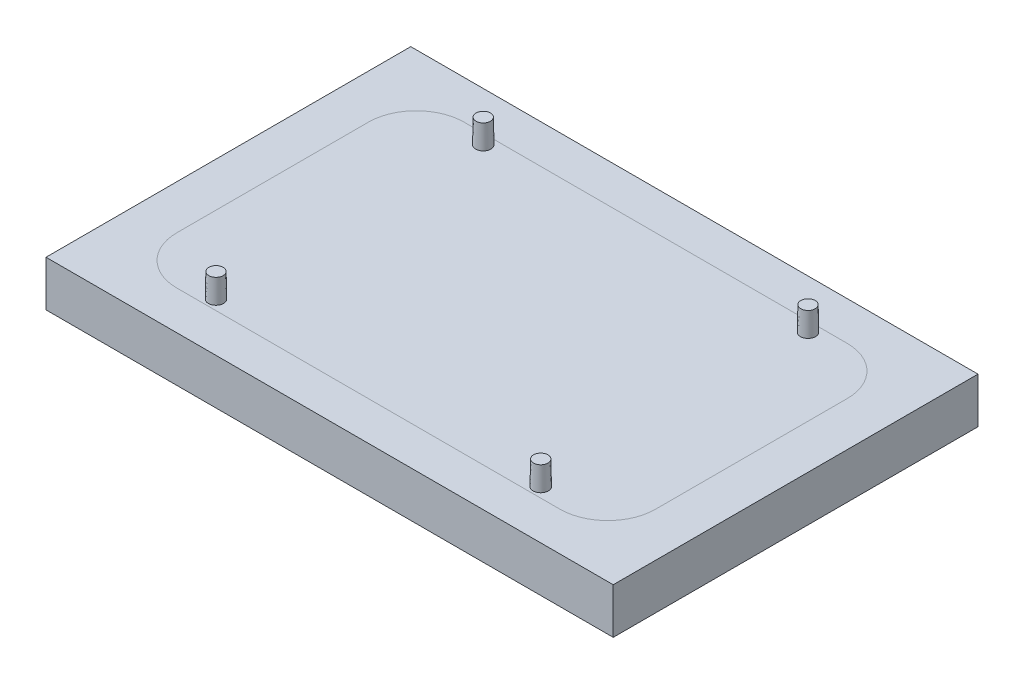
ISO-10303-21;
HEADER;
FILE_DESCRIPTION(('STEP AP214'),'2;1');
FILE_NAME('part.step','',(''),(''),'','','');
FILE_SCHEMA(('AUTOMOTIVE_DESIGN { 1 0 10303 214 1 1 1 1 }'));
ENDSEC;
DATA;
#1=APPLICATION_CONTEXT('core data for automotive mechanical design processes');
#2=APPLICATION_PROTOCOL_DEFINITION('international standard','automotive_design',2000,#1);
#3=PRODUCT_CONTEXT('',#1,'mechanical');
#4=PRODUCT('Part','Part','',(#3));
#5=PRODUCT_RELATED_PRODUCT_CATEGORY('part','',(#4));
#6=PRODUCT_DEFINITION_FORMATION('','',#4);
#7=PRODUCT_DEFINITION_CONTEXT('part definition',#1,'design');
#8=PRODUCT_DEFINITION('design','',#6,#7);
#9=PRODUCT_DEFINITION_SHAPE('','',#8);
#10=(LENGTH_UNIT() NAMED_UNIT(*) SI_UNIT(.MILLI.,.METRE.));
#11=(NAMED_UNIT(*) PLANE_ANGLE_UNIT() SI_UNIT($,.RADIAN.));
#12=(NAMED_UNIT(*) SI_UNIT($,.STERADIAN.) SOLID_ANGLE_UNIT());
#13=UNCERTAINTY_MEASURE_WITH_UNIT(LENGTH_MEASURE(1.E-05),#10,'distance_accuracy_value','');
#14=(GEOMETRIC_REPRESENTATION_CONTEXT(3) GLOBAL_UNCERTAINTY_ASSIGNED_CONTEXT((#13)) GLOBAL_UNIT_ASSIGNED_CONTEXT((#10,
#11,#12)) REPRESENTATION_CONTEXT('',''));
#15=CARTESIAN_POINT('',(0.,0.,0.));
#16=DIRECTION('',(0.,0.,1.));
#17=DIRECTION('',(1.,0.,0.));
#18=AXIS2_PLACEMENT_3D('',#15,#16,#17);
#19=CARTESIAN_POINT('',(0.,-94.8749129032242,0.));
#20=DIRECTION('',(0.,1.,0.));
#21=DIRECTION('',(0.,0.,1.));
#22=AXIS2_PLACEMENT_3D('',#19,#20,#21);
#23=PLANE('',#22);
#24=CARTESIAN_POINT('',(35.6083609091269,-94.8749129032242,29.3083609091269));
#25=DIRECTION('',(0.,1.,0.));
#26=DIRECTION('',(0.,0.,1.));
#27=AXIS2_PLACEMENT_3D('',#24,#25,#26);
#28=CIRCLE('',#27,1.575);
#29=CARTESIAN_POINT('',(35.6083609091269,-94.8749129032242,30.8833609091269));
#30=VERTEX_POINT('',#29);
#31=EDGE_CURVE('E157',#30,#30,#28,.T.);
#32=ORIENTED_EDGE('',*,*,#31,.T.);
#33=EDGE_LOOP('',(#32));
#34=FACE_BOUND('',#33,.T.);
#35=ADVANCED_FACE('F40',(#34),#23,.T.);
#36=CARTESIAN_POINT('',(35.6083609091269,-94.8749129032242,29.3083609091269));
#37=DIRECTION('',(0.,-1.,0.));
#38=DIRECTION('',(0.,0.,1.));
#39=AXIS2_PLACEMENT_3D('',#36,#37,#38);
#40=CONICAL_SURFACE('',#39,1.575,0.0174532925199433);
#41=CARTESIAN_POINT('',(35.6083609091269,-100.124912903224,29.3083609091269));
#42=DIRECTION('',(0.,1.,0.));
#43=DIRECTION('',(0.,0.,1.));
#44=AXIS2_PLACEMENT_3D('',#41,#42,#43);
#45=CIRCLE('',#44,1.66663909087315);
#46=CARTESIAN_POINT('',(35.6083609091269,-100.124912903224,30.975));
#47=VERTEX_POINT('',#46);
#48=EDGE_CURVE('E152',#47,#47,#45,.T.);
#49=ORIENTED_EDGE('',*,*,#48,.T.);
#50=EDGE_LOOP('',(#49));
#51=FACE_BOUND('',#50,.T.);
#52=ORIENTED_EDGE('',*,*,#31,.F.);
#53=EDGE_LOOP('',(#52));
#54=FACE_BOUND('',#53,.T.);
#55=ADVANCED_FACE('F285',(#51,#54),#40,.T.);
#56=CARTESIAN_POINT('',(35.6083609091269,-94.8749129032242,-29.3083609091269));
#57=DIRECTION('',(0.,-1.,0.));
#58=DIRECTION('',(0.,0.,-1.));
#59=AXIS2_PLACEMENT_3D('',#56,#57,#58);
#60=CONICAL_SURFACE('',#59,1.575,0.0174532925199433);
#61=CARTESIAN_POINT('',(35.6083609091269,-100.124912903224,-29.3083609091269));
#62=DIRECTION('',(0.,1.,0.));
#63=DIRECTION('',(0.,0.,1.));
#64=AXIS2_PLACEMENT_3D('',#61,#62,#63);
#65=CIRCLE('',#64,1.66663909087315);
#66=CARTESIAN_POINT('',(35.6083609091269,-100.124912903224,-27.6417218182537));
#67=VERTEX_POINT('',#66);
#68=EDGE_CURVE('E133',#67,#67,#65,.F.);
#69=ORIENTED_EDGE('',*,*,#68,.F.);
#70=EDGE_LOOP('',(#69));
#71=FACE_BOUND('',#70,.T.);
#72=CARTESIAN_POINT('',(35.6083609091269,-94.8749129032242,-29.3083609091269));
#73=DIRECTION('',(0.,-1.,0.));
#74=DIRECTION('',(0.,0.,-1.));
#75=AXIS2_PLACEMENT_3D('',#72,#73,#74);
#76=CIRCLE('',#75,1.575);
#77=CARTESIAN_POINT('',(35.6083609091269,-94.8749129032242,-30.8833609091269));
#78=VERTEX_POINT('',#77);
#79=EDGE_CURVE('E148',#78,#78,#76,.T.);
#80=ORIENTED_EDGE('',*,*,#79,.T.);
#81=EDGE_LOOP('',(#80));
#82=FACE_BOUND('',#81,.T.);
#83=ADVANCED_FACE('F297',(#71,#82),#60,.T.);
#84=CARTESIAN_POINT('',(-35.6083609091269,-94.8749129032242,-29.3083609091269));
#85=DIRECTION('',(0.,-1.,0.));
#86=DIRECTION('',(0.,0.,-1.));
#87=AXIS2_PLACEMENT_3D('',#84,#85,#86);
#88=CONICAL_SURFACE('',#87,1.575,0.0174532925199433);
#89=CARTESIAN_POINT('',(-35.6083609091269,-100.124912903224,-29.3083609091269));
#90=DIRECTION('',(0.,1.,0.));
#91=DIRECTION('',(0.,0.,1.));
#92=AXIS2_PLACEMENT_3D('',#89,#90,#91);
#93=CIRCLE('',#92,1.66663909087315);
#94=CARTESIAN_POINT('',(-35.6083609091269,-100.124912903224,-27.6417218182537));
#95=VERTEX_POINT('',#94);
#96=EDGE_CURVE('E139',#95,#95,#93,.T.);
#97=ORIENTED_EDGE('',*,*,#96,.T.);
#98=EDGE_LOOP('',(#97));
#99=FACE_BOUND('',#98,.T.);
#100=CARTESIAN_POINT('',(-35.6083609091269,-94.8749129032242,-29.3083609091269));
#101=DIRECTION('',(0.,1.,0.));
#102=DIRECTION('',(0.,0.,-1.));
#103=AXIS2_PLACEMENT_3D('',#100,#101,#102);
#104=CIRCLE('',#103,1.575);
#105=CARTESIAN_POINT('',(-35.6083609091269,-94.8749129032242,-30.8833609091269));
#106=VERTEX_POINT('',#105);
#107=EDGE_CURVE('E122',#106,#106,#104,.T.);
#108=ORIENTED_EDGE('',*,*,#107,.F.);
#109=EDGE_LOOP('',(#108));
#110=FACE_BOUND('',#109,.T.);
#111=ADVANCED_FACE('F308',(#99,#110),#88,.T.);
#112=CARTESIAN_POINT('',(-35.6083609091269,-94.8749129032242,29.3083609091269));
#113=DIRECTION('',(0.,-1.,0.));
#114=DIRECTION('',(0.,0.,1.));
#115=AXIS2_PLACEMENT_3D('',#112,#113,#114);
#116=CONICAL_SURFACE('',#115,1.575,0.0174532925199433);
#117=CARTESIAN_POINT('',(-35.6083609091269,-100.124912903224,29.3083609091269));
#118=DIRECTION('',(0.,1.,0.));
#119=DIRECTION('',(0.,0.,1.));
#120=AXIS2_PLACEMENT_3D('',#117,#118,#119);
#121=CIRCLE('',#120,1.66663909087315);
#122=CARTESIAN_POINT('',(-35.6083609091269,-100.124912903224,30.975));
#123=VERTEX_POINT('',#122);
#124=EDGE_CURVE('E138',#123,#123,#121,.F.);
#125=ORIENTED_EDGE('',*,*,#124,.F.);
#126=EDGE_LOOP('',(#125));
#127=FACE_BOUND('',#126,.T.);
#128=CARTESIAN_POINT('',(-35.6083609091269,-94.8749129032242,29.3083609091269));
#129=DIRECTION('',(0.,-1.,0.));
#130=DIRECTION('',(0.,0.,1.));
#131=AXIS2_PLACEMENT_3D('',#128,#129,#130);
#132=CIRCLE('',#131,1.575);
#133=CARTESIAN_POINT('',(-35.6083609091269,-94.8749129032242,30.8833609091269));
#134=VERTEX_POINT('',#133);
#135=EDGE_CURVE('E134',#134,#134,#132,.T.);
#136=ORIENTED_EDGE('',*,*,#135,.T.);
#137=EDGE_LOOP('',(#136));
#138=FACE_BOUND('',#137,.T.);
#139=ADVANCED_FACE('F319',(#127,#138),#116,.T.);
#140=CARTESIAN_POINT('',(0.,-100.124912903224,0.));
#141=DIRECTION('',(0.,1.,0.));
#142=DIRECTION('',(0.,0.,1.));
#143=AXIS2_PLACEMENT_3D('',#140,#141,#142);
#144=PLANE('',#143);
#145=ORIENTED_EDGE('',*,*,#124,.T.);
#146=EDGE_LOOP('',(#145));
#147=FACE_BOUND('',#146,.T.);
#148=ORIENTED_EDGE('',*,*,#96,.F.);
#149=EDGE_LOOP('',(#148));
#150=FACE_BOUND('',#149,.T.);
#151=ORIENTED_EDGE('',*,*,#68,.T.);
#152=EDGE_LOOP('',(#151));
#153=FACE_BOUND('',#152,.T.);
#154=ORIENTED_EDGE('',*,*,#48,.F.);
#155=EDGE_LOOP('',(#154));
#156=FACE_BOUND('',#155,.T.);
#157=DIRECTION('',(0.,0.,-1.));
#158=VECTOR('',#157,1.);
#159=CARTESIAN_POINT('',(52.5,-100.124912903224,-31.5));
#160=LINE('',#159,#158);
#161=CARTESIAN_POINT('',(52.5,-100.124912903224,21.0015992008579));
#162=VERTEX_POINT('',#161);
#163=CARTESIAN_POINT('',(52.5,-100.124912903224,-21.0015992008579));
#164=VERTEX_POINT('',#163);
#165=EDGE_CURVE('E107',#162,#164,#160,.T.);
#166=ORIENTED_EDGE('',*,*,#165,.T.);
#167=CARTESIAN_POINT('',(42.0015992008579,-100.124912903224,-31.5));
#168=CARTESIAN_POINT('',(43.035443156018,-100.124912903224,-31.5));
#169=CARTESIAN_POINT('',(44.0499059363075,-100.124912903224,-31.2982927069863));
#170=CARTESIAN_POINT('',(45.0635805260425,-100.124912903224,-31.096742131189));
#171=CARTESIAN_POINT('',(46.0194049436303,-100.124912903224,-30.700919329927));
#172=CARTESIAN_POINT('',(46.9742363236567,-100.124912903224,-30.3055077620486));
#173=CARTESIAN_POINT('',(47.8344387355147,-100.124912903224,-29.7308277192793));
#174=CARTESIAN_POINT('',(48.6937474546659,-100.124912903224,-29.1567447305938));
#175=CARTESIAN_POINT('',(49.4252835418195,-100.124912903224,-28.4252835418196));
#176=CARTESIAN_POINT('',(50.1560596120772,-100.124912903224,-27.694582292127));
#177=CARTESIAN_POINT('',(50.7308277192793,-100.124912903224,-26.8344387355147));
#178=CARTESIAN_POINT('',(51.3049986809784,-100.124912903224,-25.9751888103518));
#179=CARTESIAN_POINT('',(51.700919329927,-100.124912903224,-25.0194049436303));
#180=CARTESIAN_POINT('',(52.09642864384,-100.124912903224,-24.0646140723282));
#181=CARTESIAN_POINT('',(52.2982927069862,-100.124912903224,-23.0499059363075));
#182=CARTESIAN_POINT('',(52.5,-100.124912903224,-22.0359858351972));
#183=CARTESIAN_POINT('',(52.5,-100.124912903224,-21.0015992008579));
#184=B_SPLINE_CURVE_WITH_KNOTS('',2,(#167,#168,#169,#170,#171,#172,#173,#174,#175,#176,#177,
#178,#179,#180,#181,#182,#183),.UNSPECIFIED.,.F.,.F.,(3,2,2,2,2,2,2,2,3),(0.,0.125,0.25,0.375,
0.5,0.625,0.75,0.875,1.),.UNSPECIFIED.);
#185=CARTESIAN_POINT('',(42.0015992008579,-100.124912903224,-31.5));
#186=VERTEX_POINT('',#185);
#187=EDGE_CURVE('E98',#186,#164,#184,.T.);
#188=ORIENTED_EDGE('',*,*,#187,.F.);
#189=DIRECTION('',(-1.,0.,0.));
#190=VECTOR('',#189,1.);
#191=CARTESIAN_POINT('',(-52.5,-100.124912903224,-31.5));
#192=LINE('',#191,#190);
#193=CARTESIAN_POINT('',(-42.0015992008579,-100.124912903224,-31.5));
#194=VERTEX_POINT('',#193);
#195=EDGE_CURVE('E101',#186,#194,#192,.T.);
#196=ORIENTED_EDGE('',*,*,#195,.T.);
#197=CARTESIAN_POINT('',(-52.5,-100.124912903224,-21.0015992008579));
#198=CARTESIAN_POINT('',(-52.5,-100.124912903224,-22.0354431560098));
#199=CARTESIAN_POINT('',(-52.2982927069863,-100.124912903224,-23.0499059363075));
#200=CARTESIAN_POINT('',(-52.0967421311872,-100.124912903224,-24.0635805260594));
#201=CARTESIAN_POINT('',(-51.700919329927,-100.124912903224,-25.0194049436303));
#202=CARTESIAN_POINT('',(-51.30550776199,-100.124912903224,-25.9742363237855));
#203=CARTESIAN_POINT('',(-50.7308277192793,-100.124912903224,-26.8344387355147));
#204=CARTESIAN_POINT('',(-50.1567447305454,-100.124912903224,-27.6937474546972));
#205=CARTESIAN_POINT('',(-49.4252835418196,-100.124912903224,-28.4252835418196));
#206=CARTESIAN_POINT('',(-48.6945822921659,-100.124912903224,-29.1560596120554));
#207=CARTESIAN_POINT('',(-47.8344387355147,-100.124912903224,-29.7308277192793));
#208=CARTESIAN_POINT('',(-46.9751888102959,-100.124912903224,-30.3049986810116));
#209=CARTESIAN_POINT('',(-46.0194049436303,-100.124912903224,-30.700919329927));
#210=CARTESIAN_POINT('',(-45.0646140722493,-100.124912903224,-31.0964286438627));
#211=CARTESIAN_POINT('',(-44.0499059363075,-100.124912903224,-31.2982927069862));
#212=CARTESIAN_POINT('',(-43.0359858351619,-100.124912903224,-31.5));
#213=CARTESIAN_POINT('',(-42.0015992008579,-100.124912903224,-31.5));
#214=B_SPLINE_CURVE_WITH_KNOTS('',2,(#197,#198,#199,#200,#201,#202,#203,#204,#205,#206,#207,
#208,#209,#210,#211,#212,#213),.UNSPECIFIED.,.F.,.F.,(3,2,2,2,2,2,2,2,3),(0.,0.125,0.25,0.375,
0.5,0.625,0.75,0.875,1.),.UNSPECIFIED.);
#215=CARTESIAN_POINT('',(-52.5,-100.124912903224,-21.0015992008579));
#216=VERTEX_POINT('',#215);
#217=EDGE_CURVE('E103',#216,#194,#214,.T.);
#218=ORIENTED_EDGE('',*,*,#217,.F.);
#219=DIRECTION('',(0.,0.,1.));
#220=VECTOR('',#219,1.);
#221=CARTESIAN_POINT('',(-52.5,-100.124912903224,-31.5));
#222=LINE('',#221,#220);
#223=CARTESIAN_POINT('',(-52.5,-100.124912903224,21.0015992008579));
#224=VERTEX_POINT('',#223);
#225=EDGE_CURVE('E106',#216,#224,#222,.T.);
#226=ORIENTED_EDGE('',*,*,#225,.T.);
#227=CARTESIAN_POINT('',(-42.0015992008579,-100.124912903224,31.5));
#228=CARTESIAN_POINT('',(-43.0354431560279,-100.124912903224,31.5));
#229=CARTESIAN_POINT('',(-44.0499059363075,-100.124912903224,31.2982927069862));
#230=CARTESIAN_POINT('',(-45.0635805260743,-100.124912903224,31.0967421311807));
#231=CARTESIAN_POINT('',(-46.0194049436303,-100.124912903224,30.700919329927));
#232=CARTESIAN_POINT('',(-46.9742363237623,-100.124912903224,30.305507762));
#233=CARTESIAN_POINT('',(-47.8344387355147,-100.124912903224,29.7308277192793));
#234=CARTESIAN_POINT('',(-48.6937474547037,-100.124912903224,29.1567447305465));
#235=CARTESIAN_POINT('',(-49.4252835418196,-100.124912903224,28.4252835418195));
#236=CARTESIAN_POINT('',(-50.1560596120963,-100.124912903224,27.6945822921173));
#237=CARTESIAN_POINT('',(-50.7308277192793,-100.124912903224,26.8344387355146));
#238=CARTESIAN_POINT('',(-51.3049986810359,-100.124912903224,25.9751888102467));
#239=CARTESIAN_POINT('',(-51.700919329927,-100.124912903224,25.0194049436303));
#240=CARTESIAN_POINT('',(-52.0964286438583,-100.124912903224,24.0646140722504));
#241=CARTESIAN_POINT('',(-52.2982927069862,-100.124912903224,23.0499059363075));
#242=CARTESIAN_POINT('',(-52.5,-100.124912903224,22.0359858351833));
#243=CARTESIAN_POINT('',(-52.5,-100.124912903224,21.0015992008579));
#244=B_SPLINE_CURVE_WITH_KNOTS('',2,(#227,#228,#229,#230,#231,#232,#233,#234,#235,#236,#237,
#238,#239,#240,#241,#242,#243),.UNSPECIFIED.,.F.,.F.,(3,2,2,2,2,2,2,2,3),(0.,0.125,0.25,0.375,
0.5,0.625,0.75,0.875,1.),.UNSPECIFIED.);
#245=CARTESIAN_POINT('',(-42.0015992008579,-100.124912903224,31.5));
#246=VERTEX_POINT('',#245);
#247=EDGE_CURVE('E119',#246,#224,#244,.T.);
#248=ORIENTED_EDGE('',*,*,#247,.F.);
#249=DIRECTION('',(1.,0.,0.));
#250=VECTOR('',#249,1.);
#251=CARTESIAN_POINT('',(-52.5,-100.124912903224,31.5));
#252=LINE('',#251,#250);
#253=CARTESIAN_POINT('',(42.0015992008579,-100.124912903224,31.5));
#254=VERTEX_POINT('',#253);
#255=EDGE_CURVE('E145',#246,#254,#252,.T.);
#256=ORIENTED_EDGE('',*,*,#255,.T.);
#257=CARTESIAN_POINT('',(52.5,-100.124912903224,21.0015992008579));
#258=CARTESIAN_POINT('',(52.5,-100.124912903224,22.0354431560371));
#259=CARTESIAN_POINT('',(52.2982927069862,-100.124912903224,23.0499059363075));
#260=CARTESIAN_POINT('',(52.0967421311642,-100.124912903224,24.0635805261478));
#261=CARTESIAN_POINT('',(51.700919329927,-100.124912903224,25.0194049436303));
#262=CARTESIAN_POINT('',(51.3055077619451,-100.124912903224,25.9742363238612));
#263=CARTESIAN_POINT('',(50.7308277192793,-100.124912903224,26.8344387355147));
#264=CARTESIAN_POINT('',(50.1567447306082,-100.124912903224,27.6937474545948));
#265=CARTESIAN_POINT('',(49.4252835418196,-100.124912903224,28.4252835418196));
#266=CARTESIAN_POINT('',(48.6945822922835,-100.124912903224,29.1560596119773));
#267=CARTESIAN_POINT('',(47.8344387355147,-100.124912903224,29.7308277192793));
#268=CARTESIAN_POINT('',(46.9751888103641,-100.124912903224,30.3049986809655));
#269=CARTESIAN_POINT('',(46.0194049436303,-100.124912903224,30.700919329927));
#270=CARTESIAN_POINT('',(45.0646140723647,-100.124912903224,31.0964286438328));
#271=CARTESIAN_POINT('',(44.0499059363075,-100.124912903224,31.2982927069862));
#272=CARTESIAN_POINT('',(43.0359858351971,-100.124912903224,31.5));
#273=CARTESIAN_POINT('',(42.0015992008579,-100.124912903224,31.5));
#274=B_SPLINE_CURVE_WITH_KNOTS('',2,(#257,#258,#259,#260,#261,#262,#263,#264,#265,#266,#267,
#268,#269,#270,#271,#272,#273),.UNSPECIFIED.,.F.,.F.,(3,2,2,2,2,2,2,2,3),(0.,0.125,0.25,0.375,
0.5,0.625,0.75,0.875,1.),.UNSPECIFIED.);
#275=EDGE_CURVE('E112',#162,#254,#274,.T.);
#276=ORIENTED_EDGE('',*,*,#275,.F.);
#277=EDGE_LOOP('',(#166,#188,#196,#218,#226,#248,#256,#276));
#278=FACE_BOUND('',#277,.T.);
#279=ADVANCED_FACE('F109',(#147,#150,#153,#156,#278),#144,.T.);
#280=CARTESIAN_POINT('',(0.,-94.8749129032242,0.));
#281=DIRECTION('',(0.,1.,0.));
#282=DIRECTION('',(0.,0.,1.));
#283=AXIS2_PLACEMENT_3D('',#280,#281,#282);
#284=PLANE('',#283);
#285=ORIENTED_EDGE('',*,*,#79,.F.);
#286=EDGE_LOOP('',(#285));
#287=FACE_BOUND('',#286,.T.);
#288=ADVANCED_FACE('F340',(#287),#284,.T.);
#289=CARTESIAN_POINT('',(0.,-94.8749129032242,0.));
#290=DIRECTION('',(0.,1.,0.));
#291=DIRECTION('',(0.,0.,1.));
#292=AXIS2_PLACEMENT_3D('',#289,#290,#291);
#293=PLANE('',#292);
#294=ORIENTED_EDGE('',*,*,#107,.T.);
#295=EDGE_LOOP('',(#294));
#296=FACE_BOUND('',#295,.T.);
#297=ADVANCED_FACE('F351',(#296),#293,.T.);
#298=CARTESIAN_POINT('',(0.,-94.8749129032242,0.));
#299=DIRECTION('',(0.,1.,0.));
#300=DIRECTION('',(0.,0.,1.));
#301=AXIS2_PLACEMENT_3D('',#298,#299,#300);
#302=PLANE('',#301);
#303=ORIENTED_EDGE('',*,*,#135,.F.);
#304=EDGE_LOOP('',(#303));
#305=FACE_BOUND('',#304,.T.);
#306=ADVANCED_FACE('F362',(#305),#302,.T.);
#307=CARTESIAN_POINT('',(-52.5,-100.124912903224,-21.0015992008579));
#308=DIRECTION('',(0.,1.,0.));
#309=DIRECTION('',(0.707106781186547,0.,-0.707106781186547));
#310=AXIS2_PLACEMENT_3D('',#307,#308,#309);
#311=PLANE('',#310);
#312=DIRECTION('',(0.,0.,1.));
#313=VECTOR('',#312,1.);
#314=CARTESIAN_POINT('',(62.1970259018667,-100.124912903224,39.9989784718606));
#315=LINE('',#314,#313);
#316=CARTESIAN_POINT('',(62.1970259018667,-100.124912903224,-39.9989784718606));
#317=VERTEX_POINT('',#316);
#318=CARTESIAN_POINT('',(62.1970259018667,-100.124912903224,39.9989784718606));
#319=VERTEX_POINT('',#318);
#320=EDGE_CURVE('E51',#317,#319,#315,.T.);
#321=ORIENTED_EDGE('',*,*,#320,.F.);
#322=DIRECTION('',(1.,0.,0.));
#323=VECTOR('',#322,1.);
#324=CARTESIAN_POINT('',(-62.1970259018667,-100.124912903224,-39.9989784718606));
#325=LINE('',#324,#323);
#326=CARTESIAN_POINT('',(-62.1970259018667,-100.124912903224,-39.9989784718606));
#327=VERTEX_POINT('',#326);
#328=EDGE_CURVE('E168',#327,#317,#325,.T.);
#329=ORIENTED_EDGE('',*,*,#328,.F.);
#330=DIRECTION('',(0.,0.,-1.));
#331=VECTOR('',#330,1.);
#332=CARTESIAN_POINT('',(-62.1970259018667,-100.124912903224,39.9989784718606));
#333=LINE('',#332,#331);
#334=CARTESIAN_POINT('',(-62.1970259018667,-100.124912903224,39.9989784718606));
#335=VERTEX_POINT('',#334);
#336=EDGE_CURVE('E172',#335,#327,#333,.T.);
#337=ORIENTED_EDGE('',*,*,#336,.F.);
#338=DIRECTION('',(-1.,0.,0.));
#339=VECTOR('',#338,1.);
#340=CARTESIAN_POINT('',(-62.1970259018667,-100.124912903224,39.9989784718606));
#341=LINE('',#340,#339);
#342=EDGE_CURVE('E161',#319,#335,#341,.T.);
#343=ORIENTED_EDGE('',*,*,#342,.F.);
#344=EDGE_LOOP('',(#321,#329,#337,#343));
#345=FACE_BOUND('',#344,.T.);
#346=ORIENTED_EDGE('',*,*,#217,.T.);
#347=ORIENTED_EDGE('',*,*,#195,.F.);
#348=ORIENTED_EDGE('',*,*,#187,.T.);
#349=ORIENTED_EDGE('',*,*,#165,.F.);
#350=ORIENTED_EDGE('',*,*,#275,.T.);
#351=ORIENTED_EDGE('',*,*,#255,.F.);
#352=ORIENTED_EDGE('',*,*,#247,.T.);
#353=ORIENTED_EDGE('',*,*,#225,.F.);
#354=EDGE_LOOP('',(#346,#347,#348,#349,#350,#351,#352,#353));
#355=FACE_BOUND('',#354,.T.);
#356=ADVANCED_FACE('F42',(#345,#355),#311,.T.);
#357=CARTESIAN_POINT('',(0.,-110.124912903224,0.));
#358=DIRECTION('',(0.,-1.,0.));
#359=DIRECTION('',(0.,0.,-1.));
#360=AXIS2_PLACEMENT_3D('',#357,#358,#359);
#361=PLANE('',#360);
#362=DIRECTION('',(0.,0.,1.));
#363=VECTOR('',#362,1.);
#364=CARTESIAN_POINT('',(62.1970259018667,-110.124912903224,39.9989784718606));
#365=LINE('',#364,#363);
#366=CARTESIAN_POINT('',(62.1970259018667,-110.124912903224,-39.9989784718606));
#367=VERTEX_POINT('',#366);
#368=CARTESIAN_POINT('',(62.1970259018667,-110.124912903224,39.9989784718606));
#369=VERTEX_POINT('',#368);
#370=EDGE_CURVE('E195',#367,#369,#365,.T.);
#371=ORIENTED_EDGE('',*,*,#370,.T.);
#372=DIRECTION('',(-1.,0.,0.));
#373=VECTOR('',#372,1.);
#374=CARTESIAN_POINT('',(-62.1970259018667,-110.124912903224,39.9989784718606));
#375=LINE('',#374,#373);
#376=CARTESIAN_POINT('',(-62.1970259018667,-110.124912903224,39.9989784718606));
#377=VERTEX_POINT('',#376);
#378=EDGE_CURVE('E183',#369,#377,#375,.T.);
#379=ORIENTED_EDGE('',*,*,#378,.T.);
#380=DIRECTION('',(0.,0.,-1.));
#381=VECTOR('',#380,1.);
#382=CARTESIAN_POINT('',(-62.1970259018667,-110.124912903224,39.9989784718606));
#383=LINE('',#382,#381);
#384=CARTESIAN_POINT('',(-62.1970259018667,-110.124912903224,-39.9989784718606));
#385=VERTEX_POINT('',#384);
#386=EDGE_CURVE('E187',#377,#385,#383,.T.);
#387=ORIENTED_EDGE('',*,*,#386,.T.);
#388=DIRECTION('',(1.,0.,0.));
#389=VECTOR('',#388,1.);
#390=CARTESIAN_POINT('',(-62.1970259018667,-110.124912903224,-39.9989784718606));
#391=LINE('',#390,#389);
#392=EDGE_CURVE('E165',#385,#367,#391,.T.);
#393=ORIENTED_EDGE('',*,*,#392,.T.);
#394=EDGE_LOOP('',(#371,#379,#387,#393));
#395=FACE_BOUND('',#394,.T.);
#396=ADVANCED_FACE('F194',(#395),#361,.T.);
#397=CARTESIAN_POINT('',(-62.1970259018667,-90.1249129032242,39.9989784718606));
#398=DIRECTION('',(0.,0.,1.));
#399=DIRECTION('',(1.,0.,0.));
#400=AXIS2_PLACEMENT_3D('',#397,#398,#399);
#401=PLANE('',#400);
#402=DIRECTION('',(0.,-1.,0.));
#403=VECTOR('',#402,1.);
#404=CARTESIAN_POINT('',(62.1970259018667,-90.1249129032242,39.9989784718606));
#405=LINE('',#404,#403);
#406=EDGE_CURVE('E11',#319,#369,#405,.T.);
#407=ORIENTED_EDGE('',*,*,#406,.F.);
#408=ORIENTED_EDGE('',*,*,#342,.T.);
#409=DIRECTION('',(0.,-1.,0.));
#410=VECTOR('',#409,1.);
#411=CARTESIAN_POINT('',(-62.1970259018667,-90.1249129032242,39.9989784718606));
#412=LINE('',#411,#410);
#413=EDGE_CURVE('E164',#335,#377,#412,.T.);
#414=ORIENTED_EDGE('',*,*,#413,.T.);
#415=ORIENTED_EDGE('',*,*,#378,.F.);
#416=EDGE_LOOP('',(#407,#408,#414,#415));
#417=FACE_BOUND('',#416,.T.);
#418=ADVANCED_FACE('F181',(#417),#401,.T.);
#419=CARTESIAN_POINT('',(-62.1970259018667,-90.1249129032242,39.9989784718606));
#420=DIRECTION('',(-1.,0.,0.));
#421=DIRECTION('',(0.,0.,1.));
#422=AXIS2_PLACEMENT_3D('',#419,#420,#421);
#423=PLANE('',#422);
#424=ORIENTED_EDGE('',*,*,#413,.F.);
#425=ORIENTED_EDGE('',*,*,#336,.T.);
#426=DIRECTION('',(0.,-1.,0.));
#427=VECTOR('',#426,1.);
#428=CARTESIAN_POINT('',(-62.1970259018667,-90.1249129032242,-39.9989784718606));
#429=LINE('',#428,#427);
#430=EDGE_CURVE('E171',#327,#385,#429,.T.);
#431=ORIENTED_EDGE('',*,*,#430,.T.);
#432=ORIENTED_EDGE('',*,*,#386,.F.);
#433=EDGE_LOOP('',(#424,#425,#431,#432));
#434=FACE_BOUND('',#433,.T.);
#435=ADVANCED_FACE('F188',(#434),#423,.T.);
#436=CARTESIAN_POINT('',(-62.1970259018667,-90.1249129032242,-39.9989784718606));
#437=DIRECTION('',(0.,0.,-1.));
#438=DIRECTION('',(-1.,0.,0.));
#439=AXIS2_PLACEMENT_3D('',#436,#437,#438);
#440=PLANE('',#439);
#441=ORIENTED_EDGE('',*,*,#430,.F.);
#442=ORIENTED_EDGE('',*,*,#328,.T.);
#443=DIRECTION('',(0.,-1.,0.));
#444=VECTOR('',#443,1.);
#445=CARTESIAN_POINT('',(62.1970259018667,-90.1249129032242,-39.9989784718606));
#446=LINE('',#445,#444);
#447=EDGE_CURVE('E167',#317,#367,#446,.T.);
#448=ORIENTED_EDGE('',*,*,#447,.T.);
#449=ORIENTED_EDGE('',*,*,#392,.F.);
#450=EDGE_LOOP('',(#441,#442,#448,#449));
#451=FACE_BOUND('',#450,.T.);
#452=ADVANCED_FACE('F407',(#451),#440,.T.);
#453=CARTESIAN_POINT('',(62.1970259018667,-90.1249129032242,39.9989784718606));
#454=DIRECTION('',(1.,0.,0.));
#455=DIRECTION('',(0.,0.,-1.));
#456=AXIS2_PLACEMENT_3D('',#453,#454,#455);
#457=PLANE('',#456);
#458=ORIENTED_EDGE('',*,*,#447,.F.);
#459=ORIENTED_EDGE('',*,*,#320,.T.);
#460=ORIENTED_EDGE('',*,*,#406,.T.);
#461=ORIENTED_EDGE('',*,*,#370,.F.);
#462=EDGE_LOOP('',(#458,#459,#460,#461));
#463=FACE_BOUND('',#462,.T.);
#464=ADVANCED_FACE('F415',(#463),#457,.T.);
#465=CLOSED_SHELL('',(#35,#55,#83,#111,#139,#279,#288,#297,#306,#356,#396,#418,#435,#452,#464));
#466=MANIFOLD_SOLID_BREP('B2',#465);
#467=ADVANCED_BREP_SHAPE_REPRESENTATION('',(#18,#466),#14);
#468=SHAPE_DEFINITION_REPRESENTATION(#9,#467);
ENDSEC;
END-ISO-10303-21;
